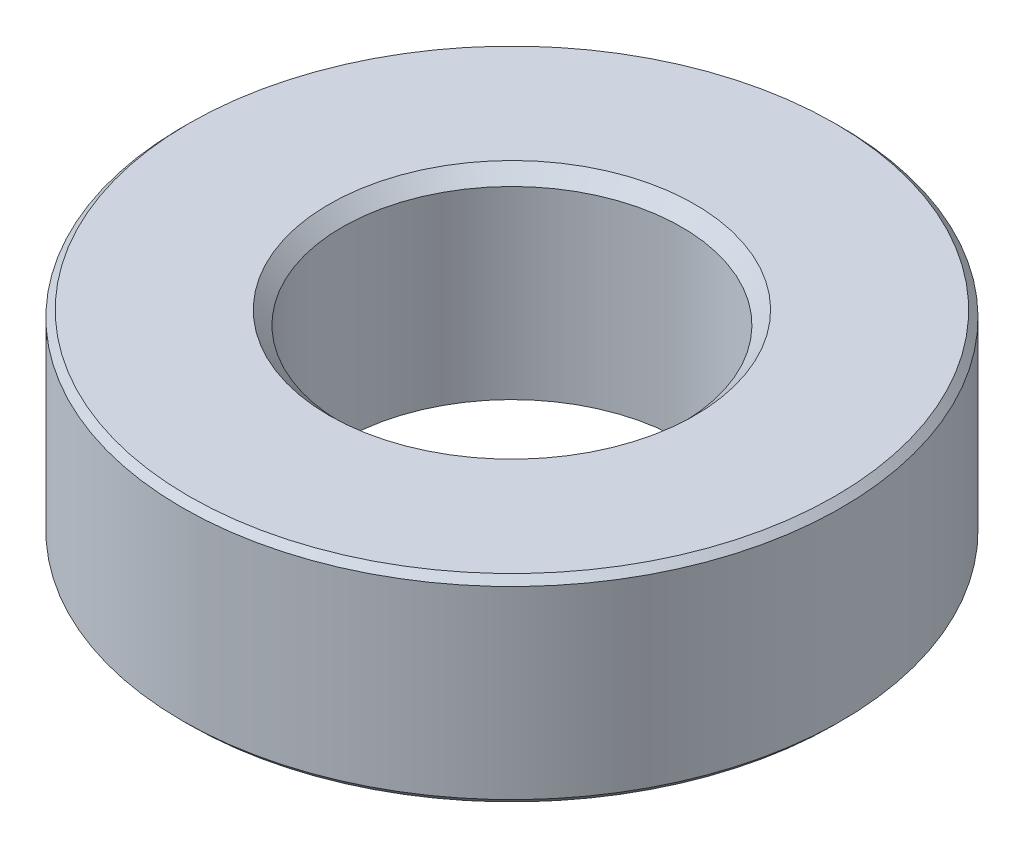
ISO-10303-21;
HEADER;
FILE_DESCRIPTION(('STEP AP214'),'2;1');
FILE_NAME('part.step','',(''),(''),'','','');
FILE_SCHEMA(('AUTOMOTIVE_DESIGN { 1 0 10303 214 1 1 1 1 }'));
ENDSEC;
DATA;
#1=APPLICATION_CONTEXT('core data for automotive mechanical design processes');
#2=APPLICATION_PROTOCOL_DEFINITION('international standard','automotive_design',2000,#1);
#3=PRODUCT_CONTEXT('',#1,'mechanical');
#4=PRODUCT('Part','Part','',(#3));
#5=PRODUCT_RELATED_PRODUCT_CATEGORY('part','',(#4));
#6=PRODUCT_DEFINITION_FORMATION('','',#4);
#7=PRODUCT_DEFINITION_CONTEXT('part definition',#1,'design');
#8=PRODUCT_DEFINITION('design','',#6,#7);
#9=PRODUCT_DEFINITION_SHAPE('','',#8);
#10=(LENGTH_UNIT() NAMED_UNIT(*) SI_UNIT(.MILLI.,.METRE.));
#11=(NAMED_UNIT(*) PLANE_ANGLE_UNIT() SI_UNIT($,.RADIAN.));
#12=(NAMED_UNIT(*) SI_UNIT($,.STERADIAN.) SOLID_ANGLE_UNIT());
#13=UNCERTAINTY_MEASURE_WITH_UNIT(LENGTH_MEASURE(1.E-05),#10,'distance_accuracy_value','');
#14=(GEOMETRIC_REPRESENTATION_CONTEXT(3) GLOBAL_UNCERTAINTY_ASSIGNED_CONTEXT((#13)) GLOBAL_UNIT_ASSIGNED_CONTEXT((#10,
#11,#12)) REPRESENTATION_CONTEXT('',''));
#15=CARTESIAN_POINT('',(0.,0.,0.));
#16=DIRECTION('',(0.,0.,1.));
#17=DIRECTION('',(1.,0.,0.));
#18=AXIS2_PLACEMENT_3D('',#15,#16,#17);
#19=CARTESIAN_POINT('',(0.,1.5,0.));
#20=DIRECTION('',(0.,1.,0.));
#21=DIRECTION('',(0.,0.,1.));
#22=AXIS2_PLACEMENT_3D('',#19,#20,#21);
#23=PLANE('',#22);
#24=CARTESIAN_POINT('',(0.,1.5,0.));
#25=DIRECTION('',(0.,1.,0.));
#26=DIRECTION('',(0.,0.,1.));
#27=AXIS2_PLACEMENT_3D('',#24,#25,#26);
#28=CIRCLE('',#27,4.9);
#29=CARTESIAN_POINT('',(0.,1.5,4.9));
#30=VERTEX_POINT('',#29);
#31=EDGE_CURVE('E8',#30,#30,#28,.T.);
#32=ORIENTED_EDGE('',*,*,#31,.T.);
#33=EDGE_LOOP('',(#32));
#34=FACE_BOUND('',#33,.T.);
#35=CARTESIAN_POINT('',(0.,1.5,0.));
#36=DIRECTION('',(0.,1.,0.));
#37=DIRECTION('',(0.,0.,1.));
#38=AXIS2_PLACEMENT_3D('',#35,#36,#37);
#39=CIRCLE('',#38,2.775);
#40=CARTESIAN_POINT('',(0.,1.5,2.775));
#41=VERTEX_POINT('',#40);
#42=EDGE_CURVE('E33',#41,#41,#39,.F.);
#43=ORIENTED_EDGE('',*,*,#42,.T.);
#44=EDGE_LOOP('',(#43));
#45=FACE_BOUND('',#44,.T.);
#46=ADVANCED_FACE('F13',(#34,#45),#23,.T.);
#47=CARTESIAN_POINT('',(0.,-1.5,0.));
#48=DIRECTION('',(0.,1.,0.));
#49=DIRECTION('',(0.,0.,1.));
#50=AXIS2_PLACEMENT_3D('',#47,#48,#49);
#51=PLANE('',#50);
#52=CARTESIAN_POINT('',(0.,-1.5,0.));
#53=DIRECTION('',(0.,1.,0.));
#54=DIRECTION('',(0.,0.,1.));
#55=AXIS2_PLACEMENT_3D('',#52,#53,#54);
#56=CIRCLE('',#55,4.9);
#57=CARTESIAN_POINT('',(0.,-1.5,4.9));
#58=VERTEX_POINT('',#57);
#59=EDGE_CURVE('E20',#58,#58,#56,.F.);
#60=ORIENTED_EDGE('',*,*,#59,.T.);
#61=EDGE_LOOP('',(#60));
#62=FACE_BOUND('',#61,.T.);
#63=CARTESIAN_POINT('',(0.,-1.5,0.));
#64=DIRECTION('',(0.,1.,0.));
#65=DIRECTION('',(0.,0.,1.));
#66=AXIS2_PLACEMENT_3D('',#63,#64,#65);
#67=CIRCLE('',#66,2.575);
#68=CARTESIAN_POINT('',(0.,-1.5,2.575));
#69=VERTEX_POINT('',#68);
#70=EDGE_CURVE('E39',#69,#69,#67,.T.);
#71=ORIENTED_EDGE('',*,*,#70,.T.);
#72=EDGE_LOOP('',(#71));
#73=FACE_BOUND('',#72,.T.);
#74=ADVANCED_FACE('F43',(#62,#73),#51,.F.);
#75=CARTESIAN_POINT('',(0.,1.5,0.));
#76=DIRECTION('',(0.,-1.,0.));
#77=DIRECTION('',(0.,0.,-1.));
#78=AXIS2_PLACEMENT_3D('',#75,#76,#77);
#79=CYLINDRICAL_SURFACE('',#78,5.);
#80=CARTESIAN_POINT('',(0.,-1.4,0.));
#81=DIRECTION('',(0.,1.,0.));
#82=DIRECTION('',(0.,0.,1.));
#83=AXIS2_PLACEMENT_3D('',#80,#81,#82);
#84=CIRCLE('',#83,5.);
#85=CARTESIAN_POINT('',(0.,-1.4,5.));
#86=VERTEX_POINT('',#85);
#87=EDGE_CURVE('E24',#86,#86,#84,.T.);
#88=ORIENTED_EDGE('',*,*,#87,.T.);
#89=EDGE_LOOP('',(#88));
#90=FACE_BOUND('',#89,.T.);
#91=CARTESIAN_POINT('',(0.,1.4,0.));
#92=DIRECTION('',(0.,1.,0.));
#93=DIRECTION('',(0.,0.,1.));
#94=AXIS2_PLACEMENT_3D('',#91,#92,#93);
#95=CIRCLE('',#94,5.);
#96=CARTESIAN_POINT('',(0.,1.4,5.));
#97=VERTEX_POINT('',#96);
#98=EDGE_CURVE('E28',#97,#97,#95,.F.);
#99=ORIENTED_EDGE('',*,*,#98,.T.);
#100=EDGE_LOOP('',(#99));
#101=FACE_BOUND('',#100,.T.);
#102=ADVANCED_FACE('F48',(#90,#101),#79,.T.);
#103=CARTESIAN_POINT('',(0.,1.5,0.));
#104=DIRECTION('',(0.,-1.,0.));
#105=DIRECTION('',(0.,0.,-1.));
#106=AXIS2_PLACEMENT_3D('',#103,#104,#105);
#107=CYLINDRICAL_SURFACE('',#106,2.575);
#108=CARTESIAN_POINT('',(0.,1.3,0.));
#109=DIRECTION('',(0.,1.,0.));
#110=DIRECTION('',(0.,0.,1.));
#111=AXIS2_PLACEMENT_3D('',#108,#109,#110);
#112=CIRCLE('',#111,2.575);
#113=CARTESIAN_POINT('',(0.,1.3,2.575));
#114=VERTEX_POINT('',#113);
#115=EDGE_CURVE('E36',#114,#114,#112,.T.);
#116=ORIENTED_EDGE('',*,*,#115,.T.);
#117=EDGE_LOOP('',(#116));
#118=FACE_BOUND('',#117,.T.);
#119=ORIENTED_EDGE('',*,*,#70,.F.);
#120=EDGE_LOOP('',(#119));
#121=FACE_BOUND('',#120,.T.);
#122=ADVANCED_FACE('F45',(#118,#121),#107,.F.);
#123=CARTESIAN_POINT('',(0.,1.3,0.));
#124=DIRECTION('',(0.,1.,0.));
#125=DIRECTION('',(0.,0.,1.));
#126=AXIS2_PLACEMENT_3D('',#123,#124,#125);
#127=CONICAL_SURFACE('',#126,2.575,0.785398163397445);
#128=ORIENTED_EDGE('',*,*,#42,.F.);
#129=EDGE_LOOP('',(#128));
#130=FACE_BOUND('',#129,.T.);
#131=ORIENTED_EDGE('',*,*,#115,.F.);
#132=EDGE_LOOP('',(#131));
#133=FACE_BOUND('',#132,.T.);
#134=ADVANCED_FACE('F47',(#130,#133),#127,.F.);
#135=CARTESIAN_POINT('',(0.,-1.4,0.));
#136=DIRECTION('',(0.,1.,0.));
#137=DIRECTION('',(0.,0.,1.));
#138=AXIS2_PLACEMENT_3D('',#135,#136,#137);
#139=CONICAL_SURFACE('',#138,5.,0.785398163397457);
#140=ORIENTED_EDGE('',*,*,#59,.F.);
#141=EDGE_LOOP('',(#140));
#142=FACE_BOUND('',#141,.T.);
#143=ORIENTED_EDGE('',*,*,#87,.F.);
#144=EDGE_LOOP('',(#143));
#145=FACE_BOUND('',#144,.T.);
#146=ADVANCED_FACE('F56',(#142,#145),#139,.T.);
#147=CARTESIAN_POINT('',(0.,1.5,0.));
#148=DIRECTION('',(0.,-1.,0.));
#149=DIRECTION('',(0.,0.,-1.));
#150=AXIS2_PLACEMENT_3D('',#147,#148,#149);
#151=CONICAL_SURFACE('',#150,4.9,0.785398163397448);
#152=ORIENTED_EDGE('',*,*,#98,.F.);
#153=EDGE_LOOP('',(#152));
#154=FACE_BOUND('',#153,.T.);
#155=ORIENTED_EDGE('',*,*,#31,.F.);
#156=EDGE_LOOP('',(#155));
#157=FACE_BOUND('',#156,.T.);
#158=ADVANCED_FACE('F15',(#154,#157),#151,.T.);
#159=CLOSED_SHELL('',(#46,#74,#102,#122,#134,#146,#158));
#160=MANIFOLD_SOLID_BREP('B1',#159);
#161=ADVANCED_BREP_SHAPE_REPRESENTATION('',(#18,#160),#14);
#162=SHAPE_DEFINITION_REPRESENTATION(#9,#161);
ENDSEC;
END-ISO-10303-21;
